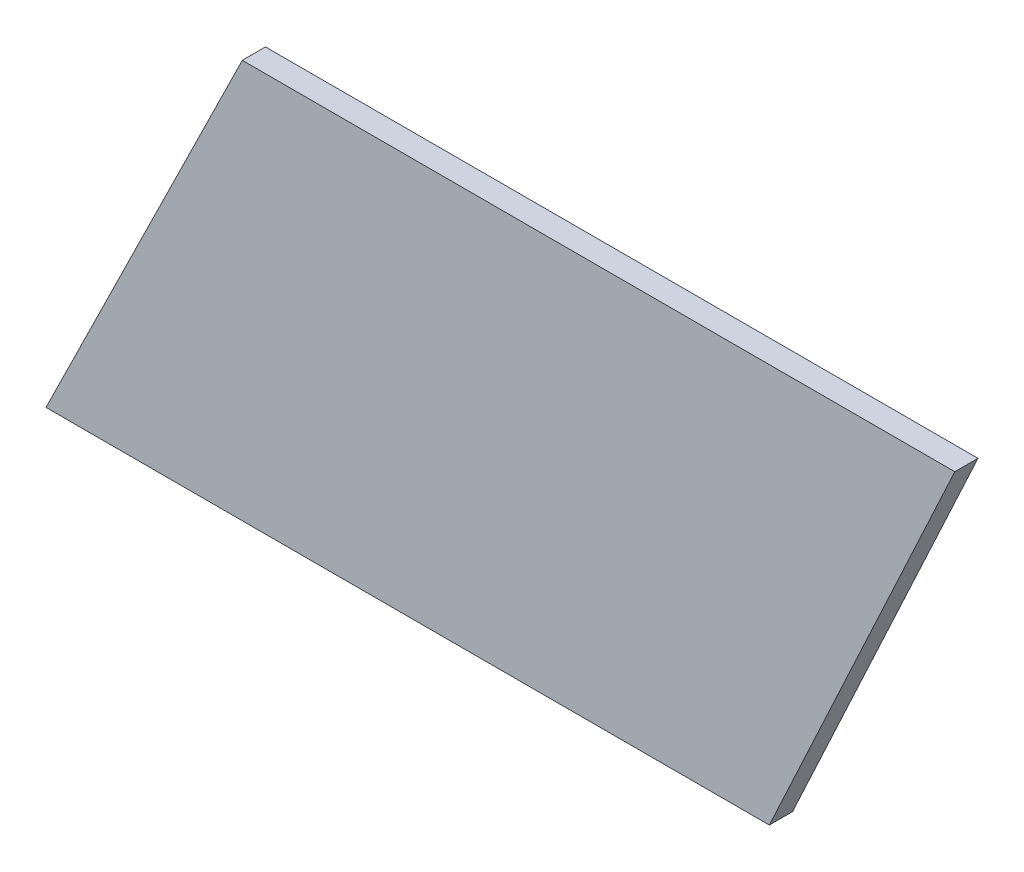
ISO-10303-21;
HEADER;
FILE_DESCRIPTION(('STEP AP214'),'2;1');
FILE_NAME('part.step','',(''),(''),'','','');
FILE_SCHEMA(('AUTOMOTIVE_DESIGN { 1 0 10303 214 1 1 1 1 }'));
ENDSEC;
DATA;
#1=APPLICATION_CONTEXT('core data for automotive mechanical design processes');
#2=APPLICATION_PROTOCOL_DEFINITION('international standard','automotive_design',2000,#1);
#3=PRODUCT_CONTEXT('',#1,'mechanical');
#4=PRODUCT('Part','Part','',(#3));
#5=PRODUCT_RELATED_PRODUCT_CATEGORY('part','',(#4));
#6=PRODUCT_DEFINITION_FORMATION('','',#4);
#7=PRODUCT_DEFINITION_CONTEXT('part definition',#1,'design');
#8=PRODUCT_DEFINITION('design','',#6,#7);
#9=PRODUCT_DEFINITION_SHAPE('','',#8);
#10=(LENGTH_UNIT() NAMED_UNIT(*) SI_UNIT(.MILLI.,.METRE.));
#11=(NAMED_UNIT(*) PLANE_ANGLE_UNIT() SI_UNIT($,.RADIAN.));
#12=(NAMED_UNIT(*) SI_UNIT($,.STERADIAN.) SOLID_ANGLE_UNIT());
#13=UNCERTAINTY_MEASURE_WITH_UNIT(LENGTH_MEASURE(1.E-05),#10,'distance_accuracy_value','');
#14=(GEOMETRIC_REPRESENTATION_CONTEXT(3) GLOBAL_UNCERTAINTY_ASSIGNED_CONTEXT((#13)) GLOBAL_UNIT_ASSIGNED_CONTEXT((#10,
#11,#12)) REPRESENTATION_CONTEXT('',''));
#15=CARTESIAN_POINT('',(0.,0.,0.));
#16=DIRECTION('',(0.,0.,1.));
#17=DIRECTION('',(1.,0.,0.));
#18=AXIS2_PLACEMENT_3D('',#15,#16,#17);
#19=CARTESIAN_POINT('',(-46.8,0.,1.5));
#20=DIRECTION('',(0.,1.,0.));
#21=DIRECTION('',(-1.,0.,0.));
#22=AXIS2_PLACEMENT_3D('',#19,#20,#21);
#23=PLANE('',#22);
#24=DIRECTION('',(1.,0.,0.));
#25=VECTOR('',#24,1.);
#26=CARTESIAN_POINT('',(-46.8,0.,0.));
#27=LINE('',#26,#25);
#28=CARTESIAN_POINT('',(-46.8,0.,0.));
#29=VERTEX_POINT('',#28);
#30=CARTESIAN_POINT('',(0.,0.,0.));
#31=VERTEX_POINT('',#30);
#32=EDGE_CURVE('E96',#29,#31,#27,.T.);
#33=ORIENTED_EDGE('',*,*,#32,.T.);
#34=DIRECTION('',(0.,0.,-1.));
#35=VECTOR('',#34,1.);
#36=CARTESIAN_POINT('',(0.,0.,1.5));
#37=LINE('',#36,#35);
#38=CARTESIAN_POINT('',(0.,0.,1.5));
#39=VERTEX_POINT('',#38);
#40=EDGE_CURVE('E11',#39,#31,#37,.T.);
#41=ORIENTED_EDGE('',*,*,#40,.F.);
#42=DIRECTION('',(1.,0.,0.));
#43=VECTOR('',#42,1.);
#44=CARTESIAN_POINT('',(-46.8,0.,1.5));
#45=LINE('',#44,#43);
#46=CARTESIAN_POINT('',(-46.8,0.,1.5));
#47=VERTEX_POINT('',#46);
#48=EDGE_CURVE('E84',#47,#39,#45,.T.);
#49=ORIENTED_EDGE('',*,*,#48,.F.);
#50=DIRECTION('',(0.,0.,-1.));
#51=VECTOR('',#50,1.);
#52=CARTESIAN_POINT('',(-46.8,0.,1.5));
#53=LINE('',#52,#51);
#54=EDGE_CURVE('E92',#47,#29,#53,.T.);
#55=ORIENTED_EDGE('',*,*,#54,.T.);
#56=EDGE_LOOP('',(#33,#41,#49,#55));
#57=FACE_BOUND('',#56,.T.);
#58=ADVANCED_FACE('F33',(#57),#23,.F.);
#59=CARTESIAN_POINT('',(0.,0.,1.5));
#60=DIRECTION('',(-0.906721111888507,0.421730749715585,0.));
#61=DIRECTION('',(-0.421730749715585,-0.906721111888507,0.));
#62=AXIS2_PLACEMENT_3D('',#59,#60,#61);
#63=PLANE('',#62);
#64=DIRECTION('',(0.421730749715585,0.906721111888507,0.));
#65=VECTOR('',#64,1.);
#66=CARTESIAN_POINT('',(0.,0.,0.));
#67=LINE('',#66,#65);
#68=CARTESIAN_POINT('',(12.,25.8,0.));
#69=VERTEX_POINT('',#68);
#70=EDGE_CURVE('E88',#31,#69,#67,.T.);
#71=ORIENTED_EDGE('',*,*,#70,.T.);
#72=DIRECTION('',(0.,0.,-1.));
#73=VECTOR('',#72,1.);
#74=CARTESIAN_POINT('',(12.,25.8,1.5));
#75=LINE('',#74,#73);
#76=CARTESIAN_POINT('',(12.,25.8,1.5));
#77=VERTEX_POINT('',#76);
#78=EDGE_CURVE('E41',#77,#69,#75,.T.);
#79=ORIENTED_EDGE('',*,*,#78,.F.);
#80=DIRECTION('',(0.421730749715585,0.906721111888507,0.));
#81=VECTOR('',#80,1.);
#82=CARTESIAN_POINT('',(0.,0.,1.5));
#83=LINE('',#82,#81);
#84=EDGE_CURVE('E79',#39,#77,#83,.T.);
#85=ORIENTED_EDGE('',*,*,#84,.F.);
#86=ORIENTED_EDGE('',*,*,#40,.T.);
#87=EDGE_LOOP('',(#71,#79,#85,#86));
#88=FACE_BOUND('',#87,.T.);
#89=ADVANCED_FACE('F87',(#88),#63,.F.);
#90=CARTESIAN_POINT('',(12.,25.8,1.5));
#91=DIRECTION('',(0.,-1.,0.));
#92=DIRECTION('',(1.,0.,0.));
#93=AXIS2_PLACEMENT_3D('',#90,#91,#92);
#94=PLANE('',#93);
#95=DIRECTION('',(-1.,0.,0.));
#96=VECTOR('',#95,1.);
#97=CARTESIAN_POINT('',(12.,25.8,0.));
#98=LINE('',#97,#96);
#99=CARTESIAN_POINT('',(-34.1,25.8,0.));
#100=VERTEX_POINT('',#99);
#101=EDGE_CURVE('E66',#69,#100,#98,.T.);
#102=ORIENTED_EDGE('',*,*,#101,.T.);
#103=DIRECTION('',(0.,0.,-1.));
#104=VECTOR('',#103,1.);
#105=CARTESIAN_POINT('',(-34.1,25.8,1.5));
#106=LINE('',#105,#104);
#107=CARTESIAN_POINT('',(-34.1,25.8,1.5));
#108=VERTEX_POINT('',#107);
#109=EDGE_CURVE('E89',#108,#100,#106,.T.);
#110=ORIENTED_EDGE('',*,*,#109,.F.);
#111=DIRECTION('',(-1.,0.,0.));
#112=VECTOR('',#111,1.);
#113=CARTESIAN_POINT('',(12.,25.8,1.5));
#114=LINE('',#113,#112);
#115=EDGE_CURVE('E82',#77,#108,#114,.T.);
#116=ORIENTED_EDGE('',*,*,#115,.F.);
#117=ORIENTED_EDGE('',*,*,#78,.T.);
#118=EDGE_LOOP('',(#102,#110,#116,#117));
#119=FACE_BOUND('',#118,.T.);
#120=ADVANCED_FACE('F90',(#119),#94,.F.);
#121=CARTESIAN_POINT('',(-34.1,25.8,1.5));
#122=DIRECTION('',(0.897191875161841,-0.441640961804472,0.));
#123=DIRECTION('',(0.441640961804472,0.897191875161841,0.));
#124=AXIS2_PLACEMENT_3D('',#121,#122,#123);
#125=PLANE('',#124);
#126=DIRECTION('',(-0.441640961804472,-0.897191875161841,0.));
#127=VECTOR('',#126,1.);
#128=CARTESIAN_POINT('',(-34.1,25.8,0.));
#129=LINE('',#128,#127);
#130=EDGE_CURVE('E72',#100,#29,#129,.T.);
#131=ORIENTED_EDGE('',*,*,#130,.T.);
#132=ORIENTED_EDGE('',*,*,#54,.F.);
#133=DIRECTION('',(-0.441640961804472,-0.897191875161841,0.));
#134=VECTOR('',#133,1.);
#135=CARTESIAN_POINT('',(-34.1,25.8,1.5));
#136=LINE('',#135,#134);
#137=EDGE_CURVE('E49',#108,#47,#136,.T.);
#138=ORIENTED_EDGE('',*,*,#137,.F.);
#139=ORIENTED_EDGE('',*,*,#109,.T.);
#140=EDGE_LOOP('',(#131,#132,#138,#139));
#141=FACE_BOUND('',#140,.T.);
#142=ADVANCED_FACE('F103',(#141),#125,.F.);
#143=CARTESIAN_POINT('',(0.,0.,1.5));
#144=DIRECTION('',(0.,0.,1.));
#145=DIRECTION('',(1.,0.,0.));
#146=AXIS2_PLACEMENT_3D('',#143,#144,#145);
#147=PLANE('',#146);
#148=ORIENTED_EDGE('',*,*,#48,.T.);
#149=ORIENTED_EDGE('',*,*,#84,.T.);
#150=ORIENTED_EDGE('',*,*,#115,.T.);
#151=ORIENTED_EDGE('',*,*,#137,.T.);
#152=EDGE_LOOP('',(#148,#149,#150,#151));
#153=FACE_BOUND('',#152,.T.);
#154=ADVANCED_FACE('F80',(#153),#147,.T.);
#155=CARTESIAN_POINT('',(0.,0.,0.));
#156=DIRECTION('',(0.,0.,1.));
#157=DIRECTION('',(1.,0.,0.));
#158=AXIS2_PLACEMENT_3D('',#155,#156,#157);
#159=PLANE('',#158);
#160=ORIENTED_EDGE('',*,*,#32,.F.);
#161=ORIENTED_EDGE('',*,*,#130,.F.);
#162=ORIENTED_EDGE('',*,*,#101,.F.);
#163=ORIENTED_EDGE('',*,*,#70,.F.);
#164=EDGE_LOOP('',(#160,#161,#162,#163));
#165=FACE_BOUND('',#164,.T.);
#166=ADVANCED_FACE('F106',(#165),#159,.F.);
#167=CLOSED_SHELL('',(#58,#89,#120,#142,#154,#166));
#168=MANIFOLD_SOLID_BREP('B2',#167);
#169=ADVANCED_BREP_SHAPE_REPRESENTATION('',(#18,#168),#14);
#170=SHAPE_DEFINITION_REPRESENTATION(#9,#169);
ENDSEC;
END-ISO-10303-21;
